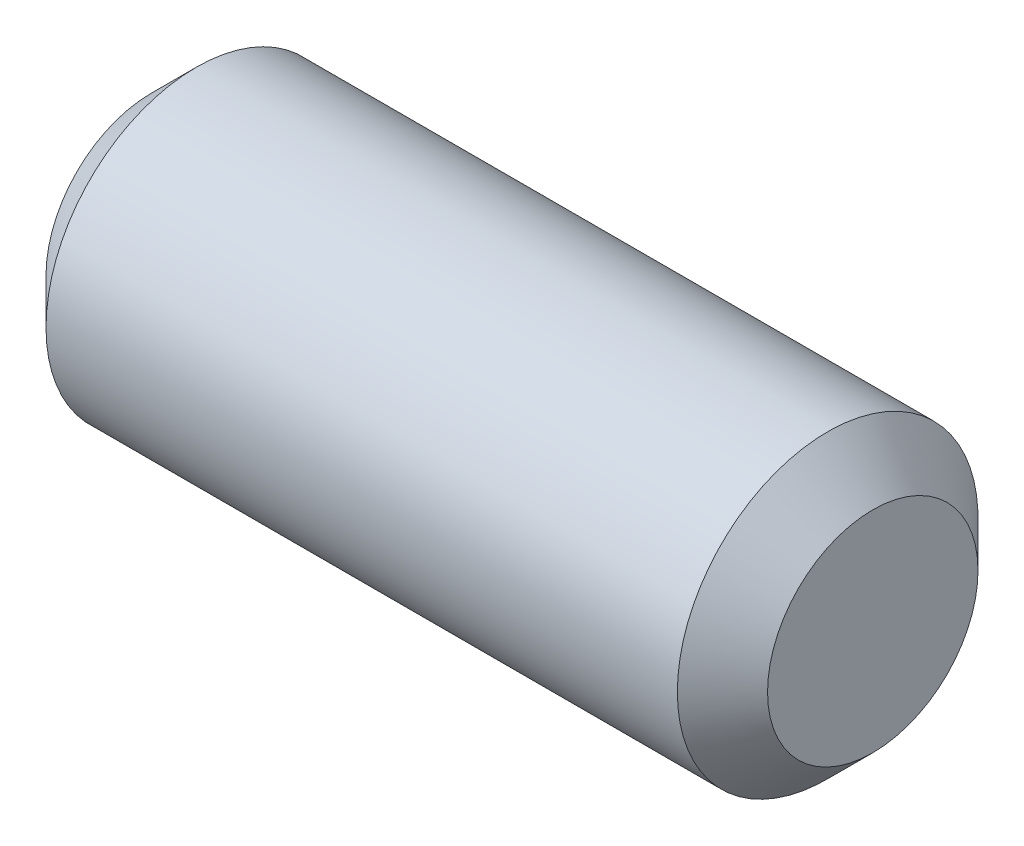
ISO-10303-21;
HEADER;
FILE_DESCRIPTION(('STEP AP214'),'2;1');
FILE_NAME('part.step','',(''),(''),'','','');
FILE_SCHEMA(('AUTOMOTIVE_DESIGN { 1 0 10303 214 1 1 1 1 }'));
ENDSEC;
DATA;
#1=APPLICATION_CONTEXT('core data for automotive mechanical design processes');
#2=APPLICATION_PROTOCOL_DEFINITION('international standard','automotive_design',2000,#1);
#3=PRODUCT_CONTEXT('',#1,'mechanical');
#4=PRODUCT('Part','Part','',(#3));
#5=PRODUCT_RELATED_PRODUCT_CATEGORY('part','',(#4));
#6=PRODUCT_DEFINITION_FORMATION('','',#4);
#7=PRODUCT_DEFINITION_CONTEXT('part definition',#1,'design');
#8=PRODUCT_DEFINITION('design','',#6,#7);
#9=PRODUCT_DEFINITION_SHAPE('','',#8);
#10=(LENGTH_UNIT() NAMED_UNIT(*) SI_UNIT(.MILLI.,.METRE.));
#11=(NAMED_UNIT(*) PLANE_ANGLE_UNIT() SI_UNIT($,.RADIAN.));
#12=(NAMED_UNIT(*) SI_UNIT($,.STERADIAN.) SOLID_ANGLE_UNIT());
#13=UNCERTAINTY_MEASURE_WITH_UNIT(LENGTH_MEASURE(1.E-05),#10,'distance_accuracy_value','');
#14=(GEOMETRIC_REPRESENTATION_CONTEXT(3) GLOBAL_UNCERTAINTY_ASSIGNED_CONTEXT((#13)) GLOBAL_UNIT_ASSIGNED_CONTEXT((#10,
#11,#12)) REPRESENTATION_CONTEXT('',''));
#15=CARTESIAN_POINT('',(0.,0.,0.));
#16=DIRECTION('',(0.,0.,1.));
#17=DIRECTION('',(1.,0.,0.));
#18=AXIS2_PLACEMENT_3D('',#15,#16,#17);
#19=CARTESIAN_POINT('',(6.,0.,0.));
#20=DIRECTION('',(1.,0.,0.));
#21=DIRECTION('',(0.,0.,-1.));
#22=AXIS2_PLACEMENT_3D('',#19,#20,#21);
#23=PLANE('',#22);
#24=CARTESIAN_POINT('',(5.99999999997181,0.,0.));
#25=DIRECTION('',(-1.,0.,0.));
#26=DIRECTION('',(0.,0.,1.));
#27=AXIS2_PLACEMENT_3D('',#24,#25,#26);
#28=CIRCLE('',#27,1.74999999995862);
#29=CARTESIAN_POINT('',(5.99999999997181,0.,1.74999999995862));
#30=VERTEX_POINT('',#29);
#31=EDGE_CURVE('E18',#30,#30,#28,.T.);
#32=ORIENTED_EDGE('',*,*,#31,.F.);
#33=EDGE_LOOP('',(#32));
#34=FACE_BOUND('',#33,.T.);
#35=ADVANCED_FACE('F15',(#34),#23,.T.);
#36=CARTESIAN_POINT('',(-6.,0.,0.));
#37=DIRECTION('',(1.,0.,0.));
#38=DIRECTION('',(0.,0.,-1.));
#39=AXIS2_PLACEMENT_3D('',#36,#37,#38);
#40=PLANE('',#39);
#41=CARTESIAN_POINT('',(-6.00000000002865,0.,0.));
#42=DIRECTION('',(1.,0.,0.));
#43=DIRECTION('',(0.,0.,-1.));
#44=AXIS2_PLACEMENT_3D('',#41,#42,#43);
#45=CIRCLE('',#44,1.75000000001546);
#46=CARTESIAN_POINT('',(-6.00000000002865,0.,-1.75000000001546));
#47=VERTEX_POINT('',#46);
#48=EDGE_CURVE('E27',#47,#47,#45,.T.);
#49=ORIENTED_EDGE('',*,*,#48,.F.);
#50=EDGE_LOOP('',(#49));
#51=FACE_BOUND('',#50,.T.);
#52=ADVANCED_FACE('F38',(#51),#40,.F.);
#53=CARTESIAN_POINT('',(5.24999999998954,0.,0.));
#54=DIRECTION('',(-1.,0.,0.));
#55=DIRECTION('',(0.,0.,1.));
#56=AXIS2_PLACEMENT_3D('',#53,#54,#55);
#57=CONICAL_SURFACE('',#56,2.49999999994088,0.785398163397448);
#58=CARTESIAN_POINT('',(5.25,0.,0.));
#59=DIRECTION('',(-1.,0.,0.));
#60=DIRECTION('',(0.,0.,1.));
#61=AXIS2_PLACEMENT_3D('',#58,#59,#60);
#62=CIRCLE('',#61,2.5);
#63=CARTESIAN_POINT('',(5.25,0.,2.5));
#64=VERTEX_POINT('',#63);
#65=EDGE_CURVE('E22',#64,#64,#62,.T.);
#66=ORIENTED_EDGE('',*,*,#65,.F.);
#67=EDGE_LOOP('',(#66));
#68=FACE_BOUND('',#67,.T.);
#69=ORIENTED_EDGE('',*,*,#31,.T.);
#70=EDGE_LOOP('',(#69));
#71=FACE_BOUND('',#70,.T.);
#72=ADVANCED_FACE('F35',(#68,#71),#57,.T.);
#73=CARTESIAN_POINT('',(-5.25000000004638,0.,0.));
#74=DIRECTION('',(1.,0.,0.));
#75=DIRECTION('',(0.,0.,-1.));
#76=AXIS2_PLACEMENT_3D('',#73,#74,#75);
#77=CONICAL_SURFACE('',#76,2.49999999999773,0.785398163397448);
#78=CARTESIAN_POINT('',(-5.25,0.,0.));
#79=DIRECTION('',(-1.,0.,0.));
#80=DIRECTION('',(0.,0.,1.));
#81=AXIS2_PLACEMENT_3D('',#78,#79,#80);
#82=CIRCLE('',#81,2.5);
#83=CARTESIAN_POINT('',(-5.25,0.,2.5));
#84=VERTEX_POINT('',#83);
#85=EDGE_CURVE('E10',#84,#84,#82,.F.);
#86=ORIENTED_EDGE('',*,*,#85,.F.);
#87=EDGE_LOOP('',(#86));
#88=FACE_BOUND('',#87,.T.);
#89=ORIENTED_EDGE('',*,*,#48,.T.);
#90=EDGE_LOOP('',(#89));
#91=FACE_BOUND('',#90,.T.);
#92=ADVANCED_FACE('F46',(#88,#91),#77,.T.);
#93=CARTESIAN_POINT('',(6.,0.,0.));
#94=DIRECTION('',(-1.,0.,0.));
#95=DIRECTION('',(0.,0.,1.));
#96=AXIS2_PLACEMENT_3D('',#93,#94,#95);
#97=CYLINDRICAL_SURFACE('',#96,2.5);
#98=ORIENTED_EDGE('',*,*,#85,.T.);
#99=EDGE_LOOP('',(#98));
#100=FACE_BOUND('',#99,.T.);
#101=ORIENTED_EDGE('',*,*,#65,.T.);
#102=EDGE_LOOP('',(#101));
#103=FACE_BOUND('',#102,.T.);
#104=ADVANCED_FACE('F44',(#100,#103),#97,.T.);
#105=CLOSED_SHELL('',(#35,#52,#72,#92,#104));
#106=MANIFOLD_SOLID_BREP('B1',#105);
#107=ADVANCED_BREP_SHAPE_REPRESENTATION('',(#18,#106),#14);
#108=SHAPE_DEFINITION_REPRESENTATION(#9,#107);
ENDSEC;
END-ISO-10303-21;
